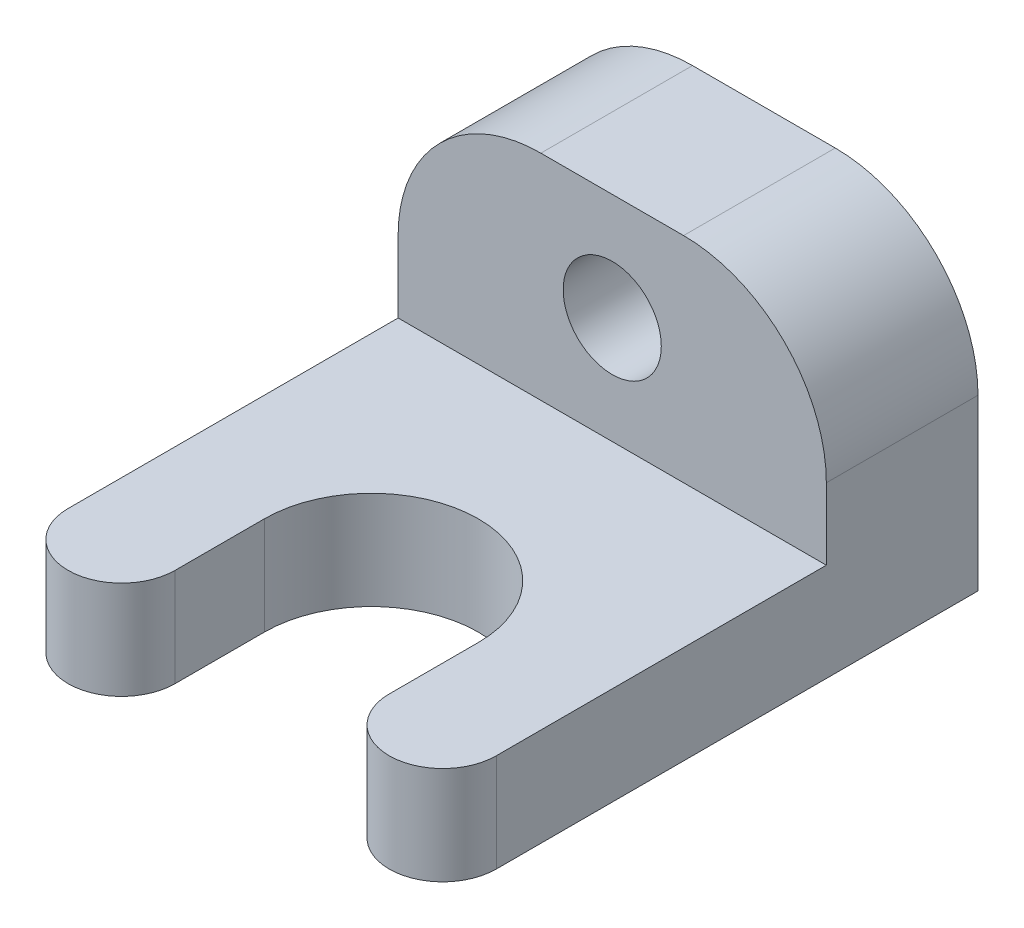
ISO-10303-21;
HEADER;
FILE_DESCRIPTION(('STEP AP214'),'2;1');
FILE_NAME('part.step','',(''),(''),'','','');
FILE_SCHEMA(('AUTOMOTIVE_DESIGN { 1 0 10303 214 1 1 1 1 }'));
ENDSEC;
DATA;
#1=APPLICATION_CONTEXT('core data for automotive mechanical design processes');
#2=APPLICATION_PROTOCOL_DEFINITION('international standard','automotive_design',2000,#1);
#3=PRODUCT_CONTEXT('',#1,'mechanical');
#4=PRODUCT('Part','Part','',(#3));
#5=PRODUCT_RELATED_PRODUCT_CATEGORY('part','',(#4));
#6=PRODUCT_DEFINITION_FORMATION('','',#4);
#7=PRODUCT_DEFINITION_CONTEXT('part definition',#1,'design');
#8=PRODUCT_DEFINITION('design','',#6,#7);
#9=PRODUCT_DEFINITION_SHAPE('','',#8);
#10=(LENGTH_UNIT() NAMED_UNIT(*) SI_UNIT(.MILLI.,.METRE.));
#11=(NAMED_UNIT(*) PLANE_ANGLE_UNIT() SI_UNIT($,.RADIAN.));
#12=(NAMED_UNIT(*) SI_UNIT($,.STERADIAN.) SOLID_ANGLE_UNIT());
#13=UNCERTAINTY_MEASURE_WITH_UNIT(LENGTH_MEASURE(1.E-05),#10,'distance_accuracy_value','');
#14=(GEOMETRIC_REPRESENTATION_CONTEXT(3) GLOBAL_UNCERTAINTY_ASSIGNED_CONTEXT((#13)) GLOBAL_UNIT_ASSIGNED_CONTEXT((#10,
#11,#12)) REPRESENTATION_CONTEXT('',''));
#15=CARTESIAN_POINT('',(0.,0.,0.));
#16=DIRECTION('',(0.,0.,1.));
#17=DIRECTION('',(1.,0.,0.));
#18=AXIS2_PLACEMENT_3D('',#15,#16,#17);
#19=CARTESIAN_POINT('',(9.,0.,5.));
#20=DIRECTION('',(0.,1.,0.));
#21=DIRECTION('',(0.,0.,1.));
#22=AXIS2_PLACEMENT_3D('',#19,#20,#21);
#23=CYLINDRICAL_SURFACE('',#22,3.);
#24=DIRECTION('',(0.,1.,0.));
#25=VECTOR('',#24,1.);
#26=CARTESIAN_POINT('',(6.00000000000001,5.5,5.));
#27=LINE('',#26,#25);
#28=CARTESIAN_POINT('',(6.00000000000001,0.,5.));
#29=VERTEX_POINT('',#28);
#30=CARTESIAN_POINT('',(6.00000000000001,5.5,5.));
#31=VERTEX_POINT('',#30);
#32=EDGE_CURVE('E218',#29,#31,#27,.T.);
#33=ORIENTED_EDGE('',*,*,#32,.F.);
#34=CARTESIAN_POINT('',(9.,0.,5.));
#35=DIRECTION('',(0.,1.,0.));
#36=DIRECTION('',(0.,0.,1.));
#37=AXIS2_PLACEMENT_3D('',#34,#35,#36);
#38=CIRCLE('',#37,3.);
#39=CARTESIAN_POINT('',(12.,0.,5.));
#40=VERTEX_POINT('',#39);
#41=EDGE_CURVE('E45',#40,#29,#38,.F.);
#42=ORIENTED_EDGE('',*,*,#41,.F.);
#43=DIRECTION('',(0.,-1.,0.));
#44=VECTOR('',#43,1.);
#45=CARTESIAN_POINT('',(12.,0.,5.));
#46=LINE('',#45,#44);
#47=CARTESIAN_POINT('',(12.,5.5,5.));
#48=VERTEX_POINT('',#47);
#49=EDGE_CURVE('E221',#48,#40,#46,.T.);
#50=ORIENTED_EDGE('',*,*,#49,.F.);
#51=CARTESIAN_POINT('',(9.,5.5,5.));
#52=DIRECTION('',(0.,1.,0.));
#53=DIRECTION('',(0.,0.,1.));
#54=AXIS2_PLACEMENT_3D('',#51,#52,#53);
#55=CIRCLE('',#54,3.);
#56=EDGE_CURVE('E11',#31,#48,#55,.T.);
#57=ORIENTED_EDGE('',*,*,#56,.F.);
#58=EDGE_LOOP('',(#33,#42,#50,#57));
#59=FACE_BOUND('',#58,.T.);
#60=ADVANCED_FACE('F37',(#59),#23,.T.);
#61=CARTESIAN_POINT('',(-9.,5.5,5.));
#62=DIRECTION('',(0.,1.,0.));
#63=DIRECTION('',(0.,0.,1.));
#64=AXIS2_PLACEMENT_3D('',#61,#62,#63);
#65=CYLINDRICAL_SURFACE('',#64,3.);
#66=DIRECTION('',(0.,-1.,0.));
#67=VECTOR('',#66,1.);
#68=CARTESIAN_POINT('',(-6.,5.5,5.));
#69=LINE('',#68,#67);
#70=CARTESIAN_POINT('',(-6.,5.5,5.));
#71=VERTEX_POINT('',#70);
#72=CARTESIAN_POINT('',(-6.,0.,5.));
#73=VERTEX_POINT('',#72);
#74=EDGE_CURVE('E208',#71,#73,#69,.T.);
#75=ORIENTED_EDGE('',*,*,#74,.F.);
#76=CARTESIAN_POINT('',(-9.,5.5,5.));
#77=DIRECTION('',(0.,1.,0.));
#78=DIRECTION('',(0.,0.,1.));
#79=AXIS2_PLACEMENT_3D('',#76,#77,#78);
#80=CIRCLE('',#79,3.);
#81=CARTESIAN_POINT('',(-12.,5.5,5.00000000000001));
#82=VERTEX_POINT('',#81);
#83=EDGE_CURVE('E214',#82,#71,#80,.T.);
#84=ORIENTED_EDGE('',*,*,#83,.F.);
#85=DIRECTION('',(0.,1.,0.));
#86=VECTOR('',#85,1.);
#87=CARTESIAN_POINT('',(-12.,5.5,5.));
#88=LINE('',#87,#86);
#89=CARTESIAN_POINT('',(-12.,0.,5.00000000000001));
#90=VERTEX_POINT('',#89);
#91=EDGE_CURVE('E211',#90,#82,#88,.T.);
#92=ORIENTED_EDGE('',*,*,#91,.F.);
#93=CARTESIAN_POINT('',(-9.,0.,5.));
#94=DIRECTION('',(0.,1.,0.));
#95=DIRECTION('',(0.,0.,1.));
#96=AXIS2_PLACEMENT_3D('',#93,#94,#95);
#97=CIRCLE('',#96,3.);
#98=EDGE_CURVE('E216',#73,#90,#97,.F.);
#99=ORIENTED_EDGE('',*,*,#98,.F.);
#100=EDGE_LOOP('',(#75,#84,#92,#99));
#101=FACE_BOUND('',#100,.T.);
#102=ADVANCED_FACE('F242',(#101),#65,.T.);
#103=CARTESIAN_POINT('',(12.,5.5,-22.));
#104=DIRECTION('',(0.,0.,1.));
#105=DIRECTION('',(1.,0.,0.));
#106=AXIS2_PLACEMENT_3D('',#103,#104,#105);
#107=PLANE('',#106);
#108=CARTESIAN_POINT('',(0.,11.5,-22.));
#109=DIRECTION('',(0.,0.,1.));
#110=DIRECTION('',(1.,0.,0.));
#111=AXIS2_PLACEMENT_3D('',#108,#109,#110);
#112=CIRCLE('',#111,2.75);
#113=CARTESIAN_POINT('',(2.75,11.5,-22.));
#114=VERTEX_POINT('',#113);
#115=EDGE_CURVE('E147',#114,#114,#112,.T.);
#116=ORIENTED_EDGE('',*,*,#115,.T.);
#117=EDGE_LOOP('',(#116));
#118=FACE_BOUND('',#117,.T.);
#119=DIRECTION('',(-1.,0.,0.));
#120=VECTOR('',#119,1.);
#121=CARTESIAN_POINT('',(-12.,17.5,-22.));
#122=LINE('',#121,#120);
#123=CARTESIAN_POINT('',(3.99999999999999,17.5,-22.));
#124=VERTEX_POINT('',#123);
#125=CARTESIAN_POINT('',(-3.99999999999999,17.5,-22.));
#126=VERTEX_POINT('',#125);
#127=EDGE_CURVE('E134',#124,#126,#122,.T.);
#128=ORIENTED_EDGE('',*,*,#127,.F.);
#129=CARTESIAN_POINT('',(3.99999999999999,9.5,-22.));
#130=DIRECTION('',(0.,0.,1.));
#131=DIRECTION('',(1.,0.,0.));
#132=AXIS2_PLACEMENT_3D('',#129,#130,#131);
#133=CIRCLE('',#132,8.);
#134=CARTESIAN_POINT('',(12.,9.5,-22.));
#135=VERTEX_POINT('',#134);
#136=EDGE_CURVE('E199',#124,#135,#133,.F.);
#137=ORIENTED_EDGE('',*,*,#136,.T.);
#138=DIRECTION('',(0.,-1.,0.));
#139=VECTOR('',#138,1.);
#140=CARTESIAN_POINT('',(12.,5.5,-22.));
#141=LINE('',#140,#139);
#142=CARTESIAN_POINT('',(12.,0.,-22.));
#143=VERTEX_POINT('',#142);
#144=EDGE_CURVE('E141',#135,#143,#141,.T.);
#145=ORIENTED_EDGE('',*,*,#144,.T.);
#146=DIRECTION('',(-1.,0.,0.));
#147=VECTOR('',#146,1.);
#148=CARTESIAN_POINT('',(12.,0.,-22.));
#149=LINE('',#148,#147);
#150=CARTESIAN_POINT('',(-12.,0.,-22.));
#151=VERTEX_POINT('',#150);
#152=EDGE_CURVE('E178',#143,#151,#149,.T.);
#153=ORIENTED_EDGE('',*,*,#152,.T.);
#154=DIRECTION('',(0.,-1.,0.));
#155=VECTOR('',#154,1.);
#156=CARTESIAN_POINT('',(-12.,5.5,-22.));
#157=LINE('',#156,#155);
#158=CARTESIAN_POINT('',(-12.,9.5,-22.));
#159=VERTEX_POINT('',#158);
#160=EDGE_CURVE('E189',#159,#151,#157,.T.);
#161=ORIENTED_EDGE('',*,*,#160,.F.);
#162=CARTESIAN_POINT('',(-3.99999999999999,9.5,-22.));
#163=DIRECTION('',(0.,0.,1.));
#164=DIRECTION('',(1.,0.,0.));
#165=AXIS2_PLACEMENT_3D('',#162,#163,#164);
#166=CIRCLE('',#165,8.);
#167=EDGE_CURVE('E197',#159,#126,#166,.F.);
#168=ORIENTED_EDGE('',*,*,#167,.T.);
#169=EDGE_LOOP('',(#128,#137,#145,#153,#161,#168));
#170=FACE_BOUND('',#169,.T.);
#171=ADVANCED_FACE('F248',(#118,#170),#107,.F.);
#172=CARTESIAN_POINT('',(-12.,5.5,-22.));
#173=DIRECTION('',(1.,0.,0.));
#174=DIRECTION('',(0.,0.,-1.));
#175=AXIS2_PLACEMENT_3D('',#172,#173,#174);
#176=PLANE('',#175);
#177=DIRECTION('',(0.,0.,1.));
#178=VECTOR('',#177,1.);
#179=CARTESIAN_POINT('',(-12.,0.,-22.));
#180=LINE('',#179,#178);
#181=EDGE_CURVE('E183',#151,#90,#180,.T.);
#182=ORIENTED_EDGE('',*,*,#181,.T.);
#183=ORIENTED_EDGE('',*,*,#91,.T.);
#184=DIRECTION('',(0.,0.,1.));
#185=VECTOR('',#184,1.);
#186=CARTESIAN_POINT('',(-12.,5.5,-22.));
#187=LINE('',#186,#185);
#188=CARTESIAN_POINT('',(-12.,5.5,-13.5));
#189=VERTEX_POINT('',#188);
#190=EDGE_CURVE('E142',#189,#82,#187,.T.);
#191=ORIENTED_EDGE('',*,*,#190,.F.);
#192=DIRECTION('',(0.,-1.,0.));
#193=VECTOR('',#192,1.);
#194=CARTESIAN_POINT('',(-12.,17.5,-13.5));
#195=LINE('',#194,#193);
#196=CARTESIAN_POINT('',(-12.,9.5,-13.5));
#197=VERTEX_POINT('',#196);
#198=EDGE_CURVE('E133',#197,#189,#195,.T.);
#199=ORIENTED_EDGE('',*,*,#198,.F.);
#200=DIRECTION('',(0.,0.,1.));
#201=VECTOR('',#200,1.);
#202=CARTESIAN_POINT('',(-12.,9.5,-22.));
#203=LINE('',#202,#201);
#204=EDGE_CURVE('E206',#197,#159,#203,.F.);
#205=ORIENTED_EDGE('',*,*,#204,.T.);
#206=ORIENTED_EDGE('',*,*,#160,.T.);
#207=EDGE_LOOP('',(#182,#183,#191,#199,#205,#206));
#208=FACE_BOUND('',#207,.T.);
#209=ADVANCED_FACE('F244',(#208),#176,.F.);
#210=CARTESIAN_POINT('',(12.,5.5,-22.));
#211=DIRECTION('',(1.,0.,0.));
#212=DIRECTION('',(0.,0.,-1.));
#213=AXIS2_PLACEMENT_3D('',#210,#211,#212);
#214=PLANE('',#213);
#215=DIRECTION('',(0.,0.,1.));
#216=VECTOR('',#215,1.);
#217=CARTESIAN_POINT('',(12.,5.5,-22.));
#218=LINE('',#217,#216);
#219=CARTESIAN_POINT('',(12.,5.5,-13.5));
#220=VERTEX_POINT('',#219);
#221=EDGE_CURVE('E126',#220,#48,#218,.T.);
#222=ORIENTED_EDGE('',*,*,#221,.T.);
#223=ORIENTED_EDGE('',*,*,#49,.T.);
#224=DIRECTION('',(0.,0.,1.));
#225=VECTOR('',#224,1.);
#226=CARTESIAN_POINT('',(12.,0.,-22.));
#227=LINE('',#226,#225);
#228=EDGE_CURVE('E179',#143,#40,#227,.T.);
#229=ORIENTED_EDGE('',*,*,#228,.F.);
#230=ORIENTED_EDGE('',*,*,#144,.F.);
#231=DIRECTION('',(0.,0.,-1.));
#232=VECTOR('',#231,1.);
#233=CARTESIAN_POINT('',(12.,9.5,-22.));
#234=LINE('',#233,#232);
#235=CARTESIAN_POINT('',(12.,9.5,-13.5));
#236=VERTEX_POINT('',#235);
#237=EDGE_CURVE('E129',#135,#236,#234,.F.);
#238=ORIENTED_EDGE('',*,*,#237,.T.);
#239=DIRECTION('',(0.,-1.,0.));
#240=VECTOR('',#239,1.);
#241=CARTESIAN_POINT('',(12.,17.5,-13.5));
#242=LINE('',#241,#240);
#243=EDGE_CURVE('E124',#236,#220,#242,.T.);
#244=ORIENTED_EDGE('',*,*,#243,.T.);
#245=EDGE_LOOP('',(#222,#223,#229,#230,#238,#244));
#246=FACE_BOUND('',#245,.T.);
#247=ADVANCED_FACE('F125',(#246),#214,.T.);
#248=CARTESIAN_POINT('',(0.,5.5,0.));
#249=DIRECTION('',(0.,1.,0.));
#250=DIRECTION('',(0.,0.,1.));
#251=AXIS2_PLACEMENT_3D('',#248,#249,#250);
#252=PLANE('',#251);
#253=DIRECTION('',(0.,0.,1.));
#254=VECTOR('',#253,1.);
#255=CARTESIAN_POINT('',(6.00000000000001,5.5,0.));
#256=LINE('',#255,#254);
#257=CARTESIAN_POINT('',(6.00000000000001,5.5,0.));
#258=VERTEX_POINT('',#257);
#259=EDGE_CURVE('E161',#258,#31,#256,.T.);
#260=ORIENTED_EDGE('',*,*,#259,.T.);
#261=ORIENTED_EDGE('',*,*,#56,.T.);
#262=ORIENTED_EDGE('',*,*,#221,.F.);
#263=DIRECTION('',(1.,0.,0.));
#264=VECTOR('',#263,1.);
#265=CARTESIAN_POINT('',(-12.,5.5,-13.5));
#266=LINE('',#265,#264);
#267=EDGE_CURVE('E139',#189,#220,#266,.T.);
#268=ORIENTED_EDGE('',*,*,#267,.F.);
#269=ORIENTED_EDGE('',*,*,#190,.T.);
#270=ORIENTED_EDGE('',*,*,#83,.T.);
#271=DIRECTION('',(0.,0.,1.));
#272=VECTOR('',#271,1.);
#273=CARTESIAN_POINT('',(-6.00000000000001,5.5,0.));
#274=LINE('',#273,#272);
#275=CARTESIAN_POINT('',(-6.00000000000001,5.5,0.));
#276=VERTEX_POINT('',#275);
#277=EDGE_CURVE('E158',#276,#71,#274,.T.);
#278=ORIENTED_EDGE('',*,*,#277,.F.);
#279=CARTESIAN_POINT('',(0.,5.5,0.));
#280=DIRECTION('',(0.,1.,0.));
#281=DIRECTION('',(0.,0.,1.));
#282=AXIS2_PLACEMENT_3D('',#279,#280,#281);
#283=CIRCLE('',#282,6.00000000000001);
#284=EDGE_CURVE('E164',#258,#276,#283,.T.);
#285=ORIENTED_EDGE('',*,*,#284,.F.);
#286=EDGE_LOOP('',(#260,#261,#262,#268,#269,#270,#278,#285));
#287=FACE_BOUND('',#286,.T.);
#288=ADVANCED_FACE('F137',(#287),#252,.T.);
#289=CARTESIAN_POINT('',(0.,0.,0.));
#290=DIRECTION('',(0.,1.,0.));
#291=DIRECTION('',(0.,0.,1.));
#292=AXIS2_PLACEMENT_3D('',#289,#290,#291);
#293=PLANE('',#292);
#294=ORIENTED_EDGE('',*,*,#228,.T.);
#295=ORIENTED_EDGE('',*,*,#41,.T.);
#296=DIRECTION('',(0.,0.,1.));
#297=VECTOR('',#296,1.);
#298=CARTESIAN_POINT('',(6.00000000000001,0.,0.));
#299=LINE('',#298,#297);
#300=CARTESIAN_POINT('',(6.00000000000001,0.,0.));
#301=VERTEX_POINT('',#300);
#302=EDGE_CURVE('E169',#301,#29,#299,.T.);
#303=ORIENTED_EDGE('',*,*,#302,.F.);
#304=CARTESIAN_POINT('',(0.,0.,0.));
#305=DIRECTION('',(0.,1.,0.));
#306=DIRECTION('',(0.,0.,1.));
#307=AXIS2_PLACEMENT_3D('',#304,#305,#306);
#308=CIRCLE('',#307,6.00000000000001);
#309=CARTESIAN_POINT('',(-6.00000000000001,0.,0.));
#310=VERTEX_POINT('',#309);
#311=EDGE_CURVE('E162',#301,#310,#308,.T.);
#312=ORIENTED_EDGE('',*,*,#311,.T.);
#313=DIRECTION('',(0.,0.,1.));
#314=VECTOR('',#313,1.);
#315=CARTESIAN_POINT('',(-6.00000000000001,0.,0.));
#316=LINE('',#315,#314);
#317=EDGE_CURVE('E157',#310,#73,#316,.T.);
#318=ORIENTED_EDGE('',*,*,#317,.T.);
#319=ORIENTED_EDGE('',*,*,#98,.T.);
#320=ORIENTED_EDGE('',*,*,#181,.F.);
#321=ORIENTED_EDGE('',*,*,#152,.F.);
#322=EDGE_LOOP('',(#294,#295,#303,#312,#318,#319,#320,#321));
#323=FACE_BOUND('',#322,.T.);
#324=ADVANCED_FACE('F224',(#323),#293,.F.);
#325=CARTESIAN_POINT('',(-6.00000000000001,5.5,0.));
#326=DIRECTION('',(1.,0.,0.));
#327=DIRECTION('',(0.,0.,-1.));
#328=AXIS2_PLACEMENT_3D('',#325,#326,#327);
#329=PLANE('',#328);
#330=ORIENTED_EDGE('',*,*,#277,.T.);
#331=ORIENTED_EDGE('',*,*,#74,.T.);
#332=ORIENTED_EDGE('',*,*,#317,.F.);
#333=DIRECTION('',(0.,-1.,0.));
#334=VECTOR('',#333,1.);
#335=CARTESIAN_POINT('',(-6.00000000000001,5.5,0.));
#336=LINE('',#335,#334);
#337=EDGE_CURVE('E166',#276,#310,#336,.T.);
#338=ORIENTED_EDGE('',*,*,#337,.F.);
#339=EDGE_LOOP('',(#330,#331,#332,#338));
#340=FACE_BOUND('',#339,.T.);
#341=ADVANCED_FACE('F238',(#340),#329,.T.);
#342=CARTESIAN_POINT('',(6.00000000000001,5.5,0.));
#343=DIRECTION('',(1.,0.,0.));
#344=DIRECTION('',(0.,0.,-1.));
#345=AXIS2_PLACEMENT_3D('',#342,#343,#344);
#346=PLANE('',#345);
#347=ORIENTED_EDGE('',*,*,#302,.T.);
#348=ORIENTED_EDGE('',*,*,#32,.T.);
#349=ORIENTED_EDGE('',*,*,#259,.F.);
#350=DIRECTION('',(0.,-1.,0.));
#351=VECTOR('',#350,1.);
#352=CARTESIAN_POINT('',(6.00000000000001,5.5,0.));
#353=LINE('',#352,#351);
#354=EDGE_CURVE('E176',#258,#301,#353,.T.);
#355=ORIENTED_EDGE('',*,*,#354,.T.);
#356=EDGE_LOOP('',(#347,#348,#349,#355));
#357=FACE_BOUND('',#356,.T.);
#358=ADVANCED_FACE('F229',(#357),#346,.F.);
#359=CARTESIAN_POINT('',(0.,5.5,0.));
#360=DIRECTION('',(0.,-1.,0.));
#361=DIRECTION('',(0.,0.,-1.));
#362=AXIS2_PLACEMENT_3D('',#359,#360,#361);
#363=CYLINDRICAL_SURFACE('',#362,6.00000000000001);
#364=ORIENTED_EDGE('',*,*,#311,.F.);
#365=ORIENTED_EDGE('',*,*,#354,.F.);
#366=ORIENTED_EDGE('',*,*,#284,.T.);
#367=ORIENTED_EDGE('',*,*,#337,.T.);
#368=EDGE_LOOP('',(#364,#365,#366,#367));
#369=FACE_BOUND('',#368,.T.);
#370=ADVANCED_FACE('F233',(#369),#363,.F.);
#371=CARTESIAN_POINT('',(-12.,17.5,-13.5));
#372=DIRECTION('',(0.,0.,-1.));
#373=DIRECTION('',(-1.,0.,0.));
#374=AXIS2_PLACEMENT_3D('',#371,#372,#373);
#375=PLANE('',#374);
#376=CARTESIAN_POINT('',(0.,11.5,-13.5));
#377=DIRECTION('',(0.,0.,1.));
#378=DIRECTION('',(1.,0.,0.));
#379=AXIS2_PLACEMENT_3D('',#376,#377,#378);
#380=CIRCLE('',#379,2.75);
#381=CARTESIAN_POINT('',(2.75,11.5,-13.5));
#382=VERTEX_POINT('',#381);
#383=EDGE_CURVE('E152',#382,#382,#380,.T.);
#384=ORIENTED_EDGE('',*,*,#383,.F.);
#385=EDGE_LOOP('',(#384));
#386=FACE_BOUND('',#385,.T.);
#387=ORIENTED_EDGE('',*,*,#243,.F.);
#388=CARTESIAN_POINT('',(3.99999999999999,9.5,-13.5));
#389=DIRECTION('',(0.,0.,-1.));
#390=DIRECTION('',(-1.,0.,0.));
#391=AXIS2_PLACEMENT_3D('',#388,#389,#390);
#392=CIRCLE('',#391,8.);
#393=CARTESIAN_POINT('',(3.99999999999999,17.5,-13.5));
#394=VERTEX_POINT('',#393);
#395=EDGE_CURVE('E204',#236,#394,#392,.F.);
#396=ORIENTED_EDGE('',*,*,#395,.T.);
#397=DIRECTION('',(1.,0.,0.));
#398=VECTOR('',#397,1.);
#399=CARTESIAN_POINT('',(-12.,17.5,-13.5));
#400=LINE('',#399,#398);
#401=CARTESIAN_POINT('',(-3.99999999999999,17.5,-13.5));
#402=VERTEX_POINT('',#401);
#403=EDGE_CURVE('E146',#402,#394,#400,.T.);
#404=ORIENTED_EDGE('',*,*,#403,.F.);
#405=CARTESIAN_POINT('',(-3.99999999999999,9.5,-13.5));
#406=DIRECTION('',(0.,0.,-1.));
#407=DIRECTION('',(-1.,0.,0.));
#408=AXIS2_PLACEMENT_3D('',#405,#406,#407);
#409=CIRCLE('',#408,8.);
#410=EDGE_CURVE('E202',#402,#197,#409,.F.);
#411=ORIENTED_EDGE('',*,*,#410,.T.);
#412=ORIENTED_EDGE('',*,*,#198,.T.);
#413=ORIENTED_EDGE('',*,*,#267,.T.);
#414=EDGE_LOOP('',(#387,#396,#404,#411,#412,#413));
#415=FACE_BOUND('',#414,.T.);
#416=ADVANCED_FACE('F144',(#386,#415),#375,.F.);
#417=CARTESIAN_POINT('',(0.,17.5,0.));
#418=DIRECTION('',(0.,1.,0.));
#419=DIRECTION('',(0.,0.,1.));
#420=AXIS2_PLACEMENT_3D('',#417,#418,#419);
#421=PLANE('',#420);
#422=ORIENTED_EDGE('',*,*,#403,.T.);
#423=DIRECTION('',(0.,0.,-1.));
#424=VECTOR('',#423,1.);
#425=CARTESIAN_POINT('',(4.,17.5,0.));
#426=LINE('',#425,#424);
#427=EDGE_CURVE('E194',#394,#124,#426,.T.);
#428=ORIENTED_EDGE('',*,*,#427,.T.);
#429=ORIENTED_EDGE('',*,*,#127,.T.);
#430=DIRECTION('',(0.,0.,1.));
#431=VECTOR('',#430,1.);
#432=CARTESIAN_POINT('',(-3.99999999999999,17.5,-13.5));
#433=LINE('',#432,#431);
#434=EDGE_CURVE('E191',#126,#402,#433,.T.);
#435=ORIENTED_EDGE('',*,*,#434,.T.);
#436=EDGE_LOOP('',(#422,#428,#429,#435));
#437=FACE_BOUND('',#436,.T.);
#438=ADVANCED_FACE('F255',(#437),#421,.T.);
#439=CARTESIAN_POINT('',(0.,11.5,-13.5));
#440=DIRECTION('',(0.,0.,1.));
#441=DIRECTION('',(1.,0.,0.));
#442=AXIS2_PLACEMENT_3D('',#439,#440,#441);
#443=CYLINDRICAL_SURFACE('',#442,2.75);
#444=ORIENTED_EDGE('',*,*,#115,.F.);
#445=EDGE_LOOP('',(#444));
#446=FACE_BOUND('',#445,.T.);
#447=ORIENTED_EDGE('',*,*,#383,.T.);
#448=EDGE_LOOP('',(#447));
#449=FACE_BOUND('',#448,.T.);
#450=ADVANCED_FACE('F266',(#446,#449),#443,.F.);
#451=CARTESIAN_POINT('',(4.,9.5,0.));
#452=DIRECTION('',(0.,0.,-1.));
#453=DIRECTION('',(-1.,0.,0.));
#454=AXIS2_PLACEMENT_3D('',#451,#452,#453);
#455=CYLINDRICAL_SURFACE('',#454,8.);
#456=ORIENTED_EDGE('',*,*,#395,.F.);
#457=ORIENTED_EDGE('',*,*,#237,.F.);
#458=ORIENTED_EDGE('',*,*,#136,.F.);
#459=ORIENTED_EDGE('',*,*,#427,.F.);
#460=EDGE_LOOP('',(#456,#457,#458,#459));
#461=FACE_BOUND('',#460,.T.);
#462=ADVANCED_FACE('F251',(#461),#455,.T.);
#463=CARTESIAN_POINT('',(-4.,9.5,0.));
#464=DIRECTION('',(0.,0.,-1.));
#465=DIRECTION('',(-1.,0.,0.));
#466=AXIS2_PLACEMENT_3D('',#463,#464,#465);
#467=CYLINDRICAL_SURFACE('',#466,8.);
#468=ORIENTED_EDGE('',*,*,#167,.F.);
#469=ORIENTED_EDGE('',*,*,#204,.F.);
#470=ORIENTED_EDGE('',*,*,#410,.F.);
#471=ORIENTED_EDGE('',*,*,#434,.F.);
#472=EDGE_LOOP('',(#468,#469,#470,#471));
#473=FACE_BOUND('',#472,.T.);
#474=ADVANCED_FACE('F259',(#473),#467,.T.);
#475=CLOSED_SHELL('',(#60,#102,#171,#209,#247,#288,#324,#341,#358,#370,#416,#438,#450,#462,#474));
#476=MANIFOLD_SOLID_BREP('B2',#475);
#477=ADVANCED_BREP_SHAPE_REPRESENTATION('',(#18,#476),#14);
#478=SHAPE_DEFINITION_REPRESENTATION(#9,#477);
ENDSEC;
END-ISO-10303-21;
